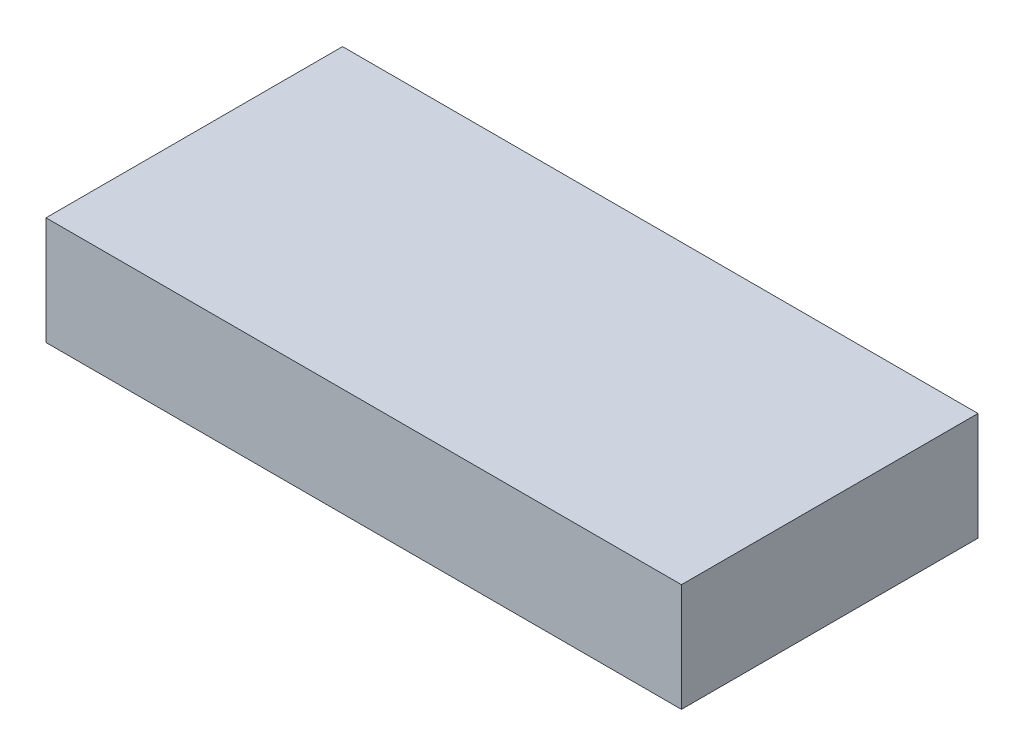
ISO-10303-21;
HEADER;
FILE_DESCRIPTION(('STEP AP214'),'2;1');
FILE_NAME('part.step','',(''),(''),'','','');
FILE_SCHEMA(('AUTOMOTIVE_DESIGN { 1 0 10303 214 1 1 1 1 }'));
ENDSEC;
DATA;
#1=APPLICATION_CONTEXT('core data for automotive mechanical design processes');
#2=APPLICATION_PROTOCOL_DEFINITION('international standard','automotive_design',2000,#1);
#3=PRODUCT_CONTEXT('',#1,'mechanical');
#4=PRODUCT('Part','Part','',(#3));
#5=PRODUCT_RELATED_PRODUCT_CATEGORY('part','',(#4));
#6=PRODUCT_DEFINITION_FORMATION('','',#4);
#7=PRODUCT_DEFINITION_CONTEXT('part definition',#1,'design');
#8=PRODUCT_DEFINITION('design','',#6,#7);
#9=PRODUCT_DEFINITION_SHAPE('','',#8);
#10=(LENGTH_UNIT() NAMED_UNIT(*) SI_UNIT(.MILLI.,.METRE.));
#11=(NAMED_UNIT(*) PLANE_ANGLE_UNIT() SI_UNIT($,.RADIAN.));
#12=(NAMED_UNIT(*) SI_UNIT($,.STERADIAN.) SOLID_ANGLE_UNIT());
#13=UNCERTAINTY_MEASURE_WITH_UNIT(LENGTH_MEASURE(1.E-05),#10,'distance_accuracy_value','');
#14=(GEOMETRIC_REPRESENTATION_CONTEXT(3) GLOBAL_UNCERTAINTY_ASSIGNED_CONTEXT((#13)) GLOBAL_UNIT_ASSIGNED_CONTEXT((#10,
#11,#12)) REPRESENTATION_CONTEXT('',''));
#15=CARTESIAN_POINT('',(0.,0.,0.));
#16=DIRECTION('',(0.,0.,1.));
#17=DIRECTION('',(1.,0.,0.));
#18=AXIS2_PLACEMENT_3D('',#15,#16,#17);
#19=CARTESIAN_POINT('',(-19.719298245614,10.2,-9.19298245614035));
#20=DIRECTION('',(1.,0.,0.));
#21=DIRECTION('',(0.,0.,-1.));
#22=AXIS2_PLACEMENT_3D('',#19,#20,#21);
#23=PLANE('',#22);
#24=DIRECTION('',(0.,0.,1.));
#25=VECTOR('',#24,1.);
#26=CARTESIAN_POINT('',(-19.719298245614,0.,-9.19298245614035));
#27=LINE('',#26,#25);
#28=CARTESIAN_POINT('',(-19.719298245614,0.,-9.19298245614035));
#29=VERTEX_POINT('',#28);
#30=CARTESIAN_POINT('',(-19.719298245614,0.,18.8070175438597));
#31=VERTEX_POINT('',#30);
#32=EDGE_CURVE('E105',#29,#31,#27,.T.);
#33=ORIENTED_EDGE('',*,*,#32,.T.);
#34=DIRECTION('',(0.,-1.,0.));
#35=VECTOR('',#34,1.);
#36=CARTESIAN_POINT('',(-19.719298245614,10.2,18.8070175438597));
#37=LINE('',#36,#35);
#38=CARTESIAN_POINT('',(-19.719298245614,10.2,18.8070175438597));
#39=VERTEX_POINT('',#38);
#40=EDGE_CURVE('E42',#39,#31,#37,.T.);
#41=ORIENTED_EDGE('',*,*,#40,.F.);
#42=DIRECTION('',(0.,0.,1.));
#43=VECTOR('',#42,1.);
#44=CARTESIAN_POINT('',(-19.719298245614,10.2,-9.19298245614035));
#45=LINE('',#44,#43);
#46=CARTESIAN_POINT('',(-19.719298245614,10.2,-9.19298245614035));
#47=VERTEX_POINT('',#46);
#48=EDGE_CURVE('E92',#47,#39,#45,.T.);
#49=ORIENTED_EDGE('',*,*,#48,.F.);
#50=DIRECTION('',(0.,-1.,0.));
#51=VECTOR('',#50,1.);
#52=CARTESIAN_POINT('',(-19.719298245614,10.2,-9.19298245614035));
#53=LINE('',#52,#51);
#54=EDGE_CURVE('E101',#47,#29,#53,.T.);
#55=ORIENTED_EDGE('',*,*,#54,.T.);
#56=EDGE_LOOP('',(#33,#41,#49,#55));
#57=FACE_BOUND('',#56,.T.);
#58=ADVANCED_FACE('F39',(#57),#23,.F.);
#59=CARTESIAN_POINT('',(-19.719298245614,10.2,18.8070175438597));
#60=DIRECTION('',(0.,0.,-1.));
#61=DIRECTION('',(-1.,0.,0.));
#62=AXIS2_PLACEMENT_3D('',#59,#60,#61);
#63=PLANE('',#62);
#64=DIRECTION('',(1.,0.,0.));
#65=VECTOR('',#64,1.);
#66=CARTESIAN_POINT('',(-19.719298245614,0.,18.8070175438597));
#67=LINE('',#66,#65);
#68=CARTESIAN_POINT('',(40.2807017543859,0.,18.8070175438597));
#69=VERTEX_POINT('',#68);
#70=EDGE_CURVE('E97',#31,#69,#67,.T.);
#71=ORIENTED_EDGE('',*,*,#70,.T.);
#72=DIRECTION('',(0.,-1.,0.));
#73=VECTOR('',#72,1.);
#74=CARTESIAN_POINT('',(40.2807017543859,10.2,18.8070175438597));
#75=LINE('',#74,#73);
#76=CARTESIAN_POINT('',(40.2807017543859,10.2,18.8070175438597));
#77=VERTEX_POINT('',#76);
#78=EDGE_CURVE('E95',#77,#69,#75,.T.);
#79=ORIENTED_EDGE('',*,*,#78,.F.);
#80=DIRECTION('',(1.,0.,0.));
#81=VECTOR('',#80,1.);
#82=CARTESIAN_POINT('',(-19.719298245614,10.2,18.8070175438597));
#83=LINE('',#82,#81);
#84=EDGE_CURVE('E87',#39,#77,#83,.T.);
#85=ORIENTED_EDGE('',*,*,#84,.F.);
#86=ORIENTED_EDGE('',*,*,#40,.T.);
#87=EDGE_LOOP('',(#71,#79,#85,#86));
#88=FACE_BOUND('',#87,.T.);
#89=ADVANCED_FACE('F96',(#88),#63,.F.);
#90=CARTESIAN_POINT('',(40.280701754386,10.2,-9.19298245614035));
#91=DIRECTION('',(-1.,0.,0.));
#92=DIRECTION('',(0.,0.,1.));
#93=AXIS2_PLACEMENT_3D('',#90,#91,#92);
#94=PLANE('',#93);
#95=DIRECTION('',(0.,0.,-1.));
#96=VECTOR('',#95,1.);
#97=CARTESIAN_POINT('',(40.280701754386,0.,-9.19298245614035));
#98=LINE('',#97,#96);
#99=CARTESIAN_POINT('',(40.280701754386,0.,-9.19298245614035));
#100=VERTEX_POINT('',#99);
#101=EDGE_CURVE('E73',#69,#100,#98,.T.);
#102=ORIENTED_EDGE('',*,*,#101,.T.);
#103=DIRECTION('',(0.,-1.,0.));
#104=VECTOR('',#103,1.);
#105=CARTESIAN_POINT('',(40.280701754386,10.2,-9.19298245614035));
#106=LINE('',#105,#104);
#107=CARTESIAN_POINT('',(40.280701754386,10.2,-9.19298245614035));
#108=VERTEX_POINT('',#107);
#109=EDGE_CURVE('E98',#108,#100,#106,.T.);
#110=ORIENTED_EDGE('',*,*,#109,.F.);
#111=DIRECTION('',(0.,0.,-1.));
#112=VECTOR('',#111,1.);
#113=CARTESIAN_POINT('',(40.280701754386,10.2,-9.19298245614035));
#114=LINE('',#113,#112);
#115=EDGE_CURVE('E90',#77,#108,#114,.T.);
#116=ORIENTED_EDGE('',*,*,#115,.F.);
#117=ORIENTED_EDGE('',*,*,#78,.T.);
#118=EDGE_LOOP('',(#102,#110,#116,#117));
#119=FACE_BOUND('',#118,.T.);
#120=ADVANCED_FACE('F99',(#119),#94,.F.);
#121=CARTESIAN_POINT('',(-19.719298245614,10.2,-9.19298245614035));
#122=DIRECTION('',(0.,0.,1.));
#123=DIRECTION('',(1.,0.,0.));
#124=AXIS2_PLACEMENT_3D('',#121,#122,#123);
#125=PLANE('',#124);
#126=DIRECTION('',(-1.,0.,0.));
#127=VECTOR('',#126,1.);
#128=CARTESIAN_POINT('',(-19.719298245614,0.,-9.19298245614035));
#129=LINE('',#128,#127);
#130=EDGE_CURVE('E79',#100,#29,#129,.T.);
#131=ORIENTED_EDGE('',*,*,#130,.T.);
#132=ORIENTED_EDGE('',*,*,#54,.F.);
#133=DIRECTION('',(-1.,0.,0.));
#134=VECTOR('',#133,1.);
#135=CARTESIAN_POINT('',(-19.719298245614,10.2,-9.19298245614035));
#136=LINE('',#135,#134);
#137=EDGE_CURVE('E56',#108,#47,#136,.T.);
#138=ORIENTED_EDGE('',*,*,#137,.F.);
#139=ORIENTED_EDGE('',*,*,#109,.T.);
#140=EDGE_LOOP('',(#131,#132,#138,#139));
#141=FACE_BOUND('',#140,.T.);
#142=ADVANCED_FACE('F113',(#141),#125,.F.);
#143=CARTESIAN_POINT('',(0.,10.2,0.));
#144=DIRECTION('',(0.,1.,0.));
#145=DIRECTION('',(0.,0.,1.));
#146=AXIS2_PLACEMENT_3D('',#143,#144,#145);
#147=PLANE('',#146);
#148=ORIENTED_EDGE('',*,*,#48,.T.);
#149=ORIENTED_EDGE('',*,*,#84,.T.);
#150=ORIENTED_EDGE('',*,*,#115,.T.);
#151=ORIENTED_EDGE('',*,*,#137,.T.);
#152=EDGE_LOOP('',(#148,#149,#150,#151));
#153=FACE_BOUND('',#152,.T.);
#154=ADVANCED_FACE('F88',(#153),#147,.T.);
#155=CARTESIAN_POINT('',(0.,0.,0.));
#156=DIRECTION('',(0.,1.,0.));
#157=DIRECTION('',(0.,0.,1.));
#158=AXIS2_PLACEMENT_3D('',#155,#156,#157);
#159=PLANE('',#158);
#160=CARTESIAN_POINT('',(21.2807017543859,0.,4.80701754385965));
#161=DIRECTION('',(0.,-1.,0.));
#162=DIRECTION('',(0.,0.,-1.));
#163=AXIS2_PLACEMENT_3D('',#160,#161,#162);
#164=CIRCLE('',#163,7.);
#165=CARTESIAN_POINT('',(21.2807017543859,0.,-2.19298245614035));
#166=VERTEX_POINT('',#165);
#167=EDGE_CURVE('E11',#166,#166,#164,.T.);
#168=ORIENTED_EDGE('',*,*,#167,.F.);
#169=EDGE_LOOP('',(#168));
#170=FACE_BOUND('',#169,.T.);
#171=ORIENTED_EDGE('',*,*,#32,.F.);
#172=ORIENTED_EDGE('',*,*,#130,.F.);
#173=ORIENTED_EDGE('',*,*,#101,.F.);
#174=ORIENTED_EDGE('',*,*,#70,.F.);
#175=EDGE_LOOP('',(#171,#172,#173,#174));
#176=FACE_BOUND('',#175,.T.);
#177=ADVANCED_FACE('F116',(#170,#176),#159,.F.);
#178=CARTESIAN_POINT('',(21.2807017543859,-2.4,4.80701754385965));
#179=DIRECTION('',(0.,1.,0.));
#180=DIRECTION('',(0.,0.,1.));
#181=AXIS2_PLACEMENT_3D('',#178,#179,#180);
#182=CYLINDRICAL_SURFACE('',#181,7.);
#183=CARTESIAN_POINT('',(21.2807017543859,-2.4,4.80701754385965));
#184=DIRECTION('',(0.,-1.,0.));
#185=DIRECTION('',(0.,0.,-1.));
#186=AXIS2_PLACEMENT_3D('',#183,#184,#185);
#187=CIRCLE('',#186,7.);
#188=CARTESIAN_POINT('',(21.2807017543859,-2.4,-2.19298245614035));
#189=VERTEX_POINT('',#188);
#190=EDGE_CURVE('E108',#189,#189,#187,.T.);
#191=ORIENTED_EDGE('',*,*,#190,.F.);
#192=EDGE_LOOP('',(#191));
#193=FACE_BOUND('',#192,.T.);
#194=ORIENTED_EDGE('',*,*,#167,.T.);
#195=EDGE_LOOP('',(#194));
#196=FACE_BOUND('',#195,.T.);
#197=ADVANCED_FACE('F124',(#193,#196),#182,.T.);
#198=CARTESIAN_POINT('',(21.2807017543859,-2.4,4.80701754385965));
#199=DIRECTION('',(0.,-1.,0.));
#200=DIRECTION('',(0.,0.,-1.));
#201=AXIS2_PLACEMENT_3D('',#198,#199,#200);
#202=PLANE('',#201);
#203=ORIENTED_EDGE('',*,*,#190,.T.);
#204=EDGE_LOOP('',(#203));
#205=FACE_BOUND('',#204,.T.);
#206=ADVANCED_FACE('F122',(#205),#202,.T.);
#207=CLOSED_SHELL('',(#58,#89,#120,#142,#154,#177,#197,#206));
#208=MANIFOLD_SOLID_BREP('B2',#207);
#209=ADVANCED_BREP_SHAPE_REPRESENTATION('',(#18,#208),#14);
#210=SHAPE_DEFINITION_REPRESENTATION(#9,#209);
ENDSEC;
END-ISO-10303-21;
